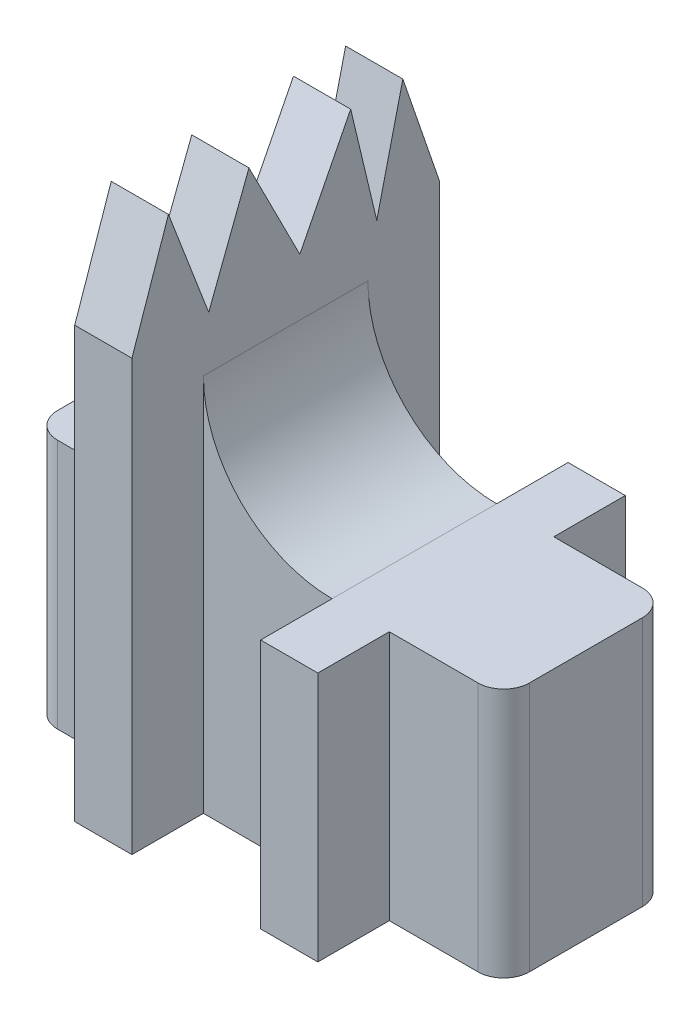
ISO-10303-21;
HEADER;
FILE_DESCRIPTION(('STEP AP214'),'2;1');
FILE_NAME('part.step','',(''),(''),'','','');
FILE_SCHEMA(('AUTOMOTIVE_DESIGN { 1 0 10303 214 1 1 1 1 }'));
ENDSEC;
DATA;
#1=APPLICATION_CONTEXT('core data for automotive mechanical design processes');
#2=APPLICATION_PROTOCOL_DEFINITION('international standard','automotive_design',2000,#1);
#3=PRODUCT_CONTEXT('',#1,'mechanical');
#4=PRODUCT('Part','Part','',(#3));
#5=PRODUCT_RELATED_PRODUCT_CATEGORY('part','',(#4));
#6=PRODUCT_DEFINITION_FORMATION('','',#4);
#7=PRODUCT_DEFINITION_CONTEXT('part definition',#1,'design');
#8=PRODUCT_DEFINITION('design','',#6,#7);
#9=PRODUCT_DEFINITION_SHAPE('','',#8);
#10=(LENGTH_UNIT() NAMED_UNIT(*) SI_UNIT(.MILLI.,.METRE.));
#11=(NAMED_UNIT(*) PLANE_ANGLE_UNIT() SI_UNIT($,.RADIAN.));
#12=(NAMED_UNIT(*) SI_UNIT($,.STERADIAN.) SOLID_ANGLE_UNIT());
#13=UNCERTAINTY_MEASURE_WITH_UNIT(LENGTH_MEASURE(1.E-05),#10,'distance_accuracy_value','');
#14=(GEOMETRIC_REPRESENTATION_CONTEXT(3) GLOBAL_UNCERTAINTY_ASSIGNED_CONTEXT((#13)) GLOBAL_UNIT_ASSIGNED_CONTEXT((#10,
#11,#12)) REPRESENTATION_CONTEXT('',''));
#15=CARTESIAN_POINT('',(0.,0.,0.));
#16=DIRECTION('',(0.,0.,1.));
#17=DIRECTION('',(1.,0.,0.));
#18=AXIS2_PLACEMENT_3D('',#15,#16,#17);
#19=CARTESIAN_POINT('',(0.,8.75,0.));
#20=DIRECTION('',(0.,1.,0.));
#21=DIRECTION('',(0.,0.,1.));
#22=AXIS2_PLACEMENT_3D('',#19,#20,#21);
#23=PLANE('',#22);
#24=DIRECTION('',(0.,0.,1.));
#25=VECTOR('',#24,1.);
#26=CARTESIAN_POINT('',(-4.25,8.75,-5.375));
#27=LINE('',#26,#25);
#28=CARTESIAN_POINT('',(-4.25,8.75,-2.875));
#29=VERTEX_POINT('',#28);
#30=CARTESIAN_POINT('',(-4.25,8.75,2.875));
#31=VERTEX_POINT('',#30);
#32=EDGE_CURVE('E355',#29,#31,#27,.T.);
#33=ORIENTED_EDGE('',*,*,#32,.F.);
#34=DIRECTION('',(1.,0.,0.));
#35=VECTOR('',#34,1.);
#36=CARTESIAN_POINT('',(0.,8.75,-2.875));
#37=LINE('',#36,#35);
#38=CARTESIAN_POINT('',(-7.35,8.75,-2.875));
#39=VERTEX_POINT('',#38);
#40=EDGE_CURVE('E398',#39,#29,#37,.T.);
#41=ORIENTED_EDGE('',*,*,#40,.F.);
#42=CARTESIAN_POINT('',(-7.35,8.75,-1.975));
#43=DIRECTION('',(0.,1.,0.));
#44=DIRECTION('',(0.,0.,1.));
#45=AXIS2_PLACEMENT_3D('',#42,#43,#44);
#46=CIRCLE('',#45,0.9);
#47=CARTESIAN_POINT('',(-8.25,8.75,-1.975));
#48=VERTEX_POINT('',#47);
#49=EDGE_CURVE('E552',#39,#48,#46,.T.);
#50=ORIENTED_EDGE('',*,*,#49,.T.);
#51=DIRECTION('',(0.,0.,-1.));
#52=VECTOR('',#51,1.);
#53=CARTESIAN_POINT('',(-8.25,8.75,0.));
#54=LINE('',#53,#52);
#55=CARTESIAN_POINT('',(-8.25,8.75,1.975));
#56=VERTEX_POINT('',#55);
#57=EDGE_CURVE('E402',#56,#48,#54,.T.);
#58=ORIENTED_EDGE('',*,*,#57,.F.);
#59=CARTESIAN_POINT('',(-7.35,8.75,1.975));
#60=DIRECTION('',(0.,1.,0.));
#61=DIRECTION('',(0.,0.,1.));
#62=AXIS2_PLACEMENT_3D('',#59,#60,#61);
#63=CIRCLE('',#62,0.9);
#64=CARTESIAN_POINT('',(-7.35,8.75,2.875));
#65=VERTEX_POINT('',#64);
#66=EDGE_CURVE('E555',#56,#65,#63,.T.);
#67=ORIENTED_EDGE('',*,*,#66,.T.);
#68=DIRECTION('',(1.,0.,0.));
#69=VECTOR('',#68,1.);
#70=CARTESIAN_POINT('',(0.,8.75,2.875));
#71=LINE('',#70,#69);
#72=EDGE_CURVE('E361',#65,#31,#71,.T.);
#73=ORIENTED_EDGE('',*,*,#72,.T.);
#74=EDGE_LOOP('',(#33,#41,#50,#58,#67,#73));
#75=FACE_BOUND('',#74,.T.);
#76=ADVANCED_FACE('F60',(#75),#23,.T.);
#77=CARTESIAN_POINT('',(0.,8.75,2.875));
#78=DIRECTION('',(0.,0.,-1.));
#79=DIRECTION('',(-1.,0.,0.));
#80=AXIS2_PLACEMENT_3D('',#77,#78,#79);
#81=PLANE('',#80);
#82=ORIENTED_EDGE('',*,*,#72,.F.);
#83=DIRECTION('',(0.,-1.,0.));
#84=VECTOR('',#83,1.);
#85=CARTESIAN_POINT('',(-7.35,0.,2.875));
#86=LINE('',#85,#84);
#87=CARTESIAN_POINT('',(-7.35,0.,2.875));
#88=VERTEX_POINT('',#87);
#89=EDGE_CURVE('E567',#65,#88,#86,.T.);
#90=ORIENTED_EDGE('',*,*,#89,.T.);
#91=DIRECTION('',(1.,0.,0.));
#92=VECTOR('',#91,1.);
#93=CARTESIAN_POINT('',(0.,0.,2.875));
#94=LINE('',#93,#92);
#95=CARTESIAN_POINT('',(-4.25,0.,2.875));
#96=VERTEX_POINT('',#95);
#97=EDGE_CURVE('E354',#88,#96,#94,.T.);
#98=ORIENTED_EDGE('',*,*,#97,.T.);
#99=DIRECTION('',(0.,-1.,0.));
#100=VECTOR('',#99,1.);
#101=CARTESIAN_POINT('',(-4.25,8.75,2.875));
#102=LINE('',#101,#100);
#103=EDGE_CURVE('E525',#31,#96,#102,.T.);
#104=ORIENTED_EDGE('',*,*,#103,.F.);
#105=EDGE_LOOP('',(#82,#90,#98,#104));
#106=FACE_BOUND('',#105,.T.);
#107=ADVANCED_FACE('F706',(#106),#81,.F.);
#108=CARTESIAN_POINT('',(0.,8.75,5.375));
#109=DIRECTION('',(0.,0.,-1.));
#110=DIRECTION('',(-1.,0.,0.));
#111=AXIS2_PLACEMENT_3D('',#108,#109,#110);
#112=PLANE('',#111);
#113=DIRECTION('',(0.,-1.,0.));
#114=VECTOR('',#113,1.);
#115=CARTESIAN_POINT('',(-2.25,8.75,5.375));
#116=LINE('',#115,#114);
#117=CARTESIAN_POINT('',(-2.25,15.0316881367215,5.375));
#118=VERTEX_POINT('',#117);
#119=CARTESIAN_POINT('',(-2.25,0.,5.375));
#120=VERTEX_POINT('',#119);
#121=EDGE_CURVE('E519',#118,#120,#116,.T.);
#122=ORIENTED_EDGE('',*,*,#121,.F.);
#123=DIRECTION('',(-1.,0.,0.));
#124=VECTOR('',#123,1.);
#125=CARTESIAN_POINT('',(8.25,15.0316881367215,5.375));
#126=LINE('',#125,#124);
#127=CARTESIAN_POINT('',(-4.25,15.0316881367215,5.375));
#128=VERTEX_POINT('',#127);
#129=EDGE_CURVE('E329',#118,#128,#126,.T.);
#130=ORIENTED_EDGE('',*,*,#129,.T.);
#131=DIRECTION('',(0.,-1.,0.));
#132=VECTOR('',#131,1.);
#133=CARTESIAN_POINT('',(-4.25,8.75,5.375));
#134=LINE('',#133,#132);
#135=CARTESIAN_POINT('',(-4.25,0.,5.375));
#136=VERTEX_POINT('',#135);
#137=EDGE_CURVE('E522',#128,#136,#134,.T.);
#138=ORIENTED_EDGE('',*,*,#137,.T.);
#139=DIRECTION('',(1.,0.,0.));
#140=VECTOR('',#139,1.);
#141=CARTESIAN_POINT('',(0.,0.,5.375));
#142=LINE('',#141,#140);
#143=EDGE_CURVE('E413',#136,#120,#142,.T.);
#144=ORIENTED_EDGE('',*,*,#143,.T.);
#145=EDGE_LOOP('',(#122,#130,#138,#144));
#146=FACE_BOUND('',#145,.T.);
#147=ADVANCED_FACE('F690',(#146),#112,.F.);
#148=CARTESIAN_POINT('',(0.,8.75,2.875));
#149=DIRECTION('',(0.,0.,-1.));
#150=DIRECTION('',(-1.,0.,0.));
#151=AXIS2_PLACEMENT_3D('',#148,#149,#150);
#152=PLANE('',#151);
#153=DIRECTION('',(1.,0.,0.));
#154=VECTOR('',#153,1.);
#155=CARTESIAN_POINT('',(0.,0.,2.875));
#156=LINE('',#155,#154);
#157=CARTESIAN_POINT('',(-2.25,0.,2.875));
#158=VERTEX_POINT('',#157);
#159=CARTESIAN_POINT('',(2.25,0.,2.875));
#160=VERTEX_POINT('',#159);
#161=EDGE_CURVE('E420',#158,#160,#156,.T.);
#162=ORIENTED_EDGE('',*,*,#161,.T.);
#163=DIRECTION('',(0.,-1.,0.));
#164=VECTOR('',#163,1.);
#165=CARTESIAN_POINT('',(2.25,8.75,2.875));
#166=LINE('',#165,#164);
#167=CARTESIAN_POINT('',(2.25,8.75,2.875));
#168=VERTEX_POINT('',#167);
#169=EDGE_CURVE('E514',#168,#160,#166,.T.);
#170=ORIENTED_EDGE('',*,*,#169,.F.);
#171=CARTESIAN_POINT('',(2.25,13.25,2.875));
#172=DIRECTION('',(0.,0.,-1.));
#173=DIRECTION('',(-1.,0.,0.));
#174=AXIS2_PLACEMENT_3D('',#171,#172,#173);
#175=CIRCLE('',#174,4.5);
#176=CARTESIAN_POINT('',(-2.25,13.25,2.875));
#177=VERTEX_POINT('',#176);
#178=EDGE_CURVE('E12',#168,#177,#175,.T.);
#179=ORIENTED_EDGE('',*,*,#178,.T.);
#180=DIRECTION('',(0.,-1.,0.));
#181=VECTOR('',#180,1.);
#182=CARTESIAN_POINT('',(-2.25,8.75,2.875));
#183=LINE('',#182,#181);
#184=EDGE_CURVE('E84',#177,#158,#183,.T.);
#185=ORIENTED_EDGE('',*,*,#184,.T.);
#186=EDGE_LOOP('',(#162,#170,#179,#185));
#187=FACE_BOUND('',#186,.T.);
#188=ADVANCED_FACE('F615',(#187),#152,.F.);
#189=CARTESIAN_POINT('',(2.25,8.75,0.));
#190=DIRECTION('',(-1.,0.,0.));
#191=DIRECTION('',(0.,0.,1.));
#192=AXIS2_PLACEMENT_3D('',#189,#190,#191);
#193=PLANE('',#192);
#194=DIRECTION('',(0.,0.,-1.));
#195=VECTOR('',#194,1.);
#196=CARTESIAN_POINT('',(2.25,0.,0.));
#197=LINE('',#196,#195);
#198=CARTESIAN_POINT('',(2.25,0.,5.375));
#199=VERTEX_POINT('',#198);
#200=EDGE_CURVE('E424',#199,#160,#197,.T.);
#201=ORIENTED_EDGE('',*,*,#200,.F.);
#202=DIRECTION('',(0.,-1.,0.));
#203=VECTOR('',#202,1.);
#204=CARTESIAN_POINT('',(2.25,8.75,5.375));
#205=LINE('',#204,#203);
#206=CARTESIAN_POINT('',(2.25,8.75,5.375));
#207=VERTEX_POINT('',#206);
#208=EDGE_CURVE('E511',#207,#199,#205,.T.);
#209=ORIENTED_EDGE('',*,*,#208,.F.);
#210=DIRECTION('',(0.,0.,-1.));
#211=VECTOR('',#210,1.);
#212=CARTESIAN_POINT('',(2.25,8.75,0.));
#213=LINE('',#212,#211);
#214=EDGE_CURVE('E364',#207,#168,#213,.T.);
#215=ORIENTED_EDGE('',*,*,#214,.T.);
#216=ORIENTED_EDGE('',*,*,#169,.T.);
#217=EDGE_LOOP('',(#201,#209,#215,#216));
#218=FACE_BOUND('',#217,.T.);
#219=ADVANCED_FACE('F619',(#218),#193,.T.);
#220=CARTESIAN_POINT('',(0.,8.75,5.375));
#221=DIRECTION('',(0.,0.,1.));
#222=DIRECTION('',(1.,0.,0.));
#223=AXIS2_PLACEMENT_3D('',#220,#221,#222);
#224=PLANE('',#223);
#225=DIRECTION('',(-1.,0.,0.));
#226=VECTOR('',#225,1.);
#227=CARTESIAN_POINT('',(0.,0.,5.375));
#228=LINE('',#227,#226);
#229=CARTESIAN_POINT('',(4.25,0.,5.375));
#230=VERTEX_POINT('',#229);
#231=EDGE_CURVE('E428',#230,#199,#228,.T.);
#232=ORIENTED_EDGE('',*,*,#231,.F.);
#233=DIRECTION('',(0.,-1.,0.));
#234=VECTOR('',#233,1.);
#235=CARTESIAN_POINT('',(4.25,8.75,5.375));
#236=LINE('',#235,#234);
#237=CARTESIAN_POINT('',(4.25,8.75,5.375));
#238=VERTEX_POINT('',#237);
#239=EDGE_CURVE('E508',#238,#230,#236,.T.);
#240=ORIENTED_EDGE('',*,*,#239,.F.);
#241=DIRECTION('',(-1.,0.,0.));
#242=VECTOR('',#241,1.);
#243=CARTESIAN_POINT('',(0.,8.75,5.375));
#244=LINE('',#243,#242);
#245=EDGE_CURVE('E369',#238,#207,#244,.T.);
#246=ORIENTED_EDGE('',*,*,#245,.T.);
#247=ORIENTED_EDGE('',*,*,#208,.T.);
#248=EDGE_LOOP('',(#232,#240,#246,#247));
#249=FACE_BOUND('',#248,.T.);
#250=ADVANCED_FACE('F623',(#249),#224,.T.);
#251=CARTESIAN_POINT('',(4.25,8.75,0.));
#252=DIRECTION('',(-1.,0.,0.));
#253=DIRECTION('',(0.,0.,1.));
#254=AXIS2_PLACEMENT_3D('',#251,#252,#253);
#255=PLANE('',#254);
#256=DIRECTION('',(0.,0.,-1.));
#257=VECTOR('',#256,1.);
#258=CARTESIAN_POINT('',(4.25,0.,0.));
#259=LINE('',#258,#257);
#260=CARTESIAN_POINT('',(4.25,0.,2.875));
#261=VERTEX_POINT('',#260);
#262=EDGE_CURVE('E432',#230,#261,#259,.T.);
#263=ORIENTED_EDGE('',*,*,#262,.T.);
#264=DIRECTION('',(0.,-1.,0.));
#265=VECTOR('',#264,1.);
#266=CARTESIAN_POINT('',(4.25,8.75,2.875));
#267=LINE('',#266,#265);
#268=CARTESIAN_POINT('',(4.25,8.75,2.875));
#269=VERTEX_POINT('',#268);
#270=EDGE_CURVE('E504',#269,#261,#267,.T.);
#271=ORIENTED_EDGE('',*,*,#270,.F.);
#272=DIRECTION('',(0.,0.,-1.));
#273=VECTOR('',#272,1.);
#274=CARTESIAN_POINT('',(4.25,8.75,0.));
#275=LINE('',#274,#273);
#276=EDGE_CURVE('E373',#238,#269,#275,.T.);
#277=ORIENTED_EDGE('',*,*,#276,.F.);
#278=ORIENTED_EDGE('',*,*,#239,.T.);
#279=EDGE_LOOP('',(#263,#271,#277,#278));
#280=FACE_BOUND('',#279,.T.);
#281=ADVANCED_FACE('F628',(#280),#255,.F.);
#282=CARTESIAN_POINT('',(0.,8.75,2.875));
#283=DIRECTION('',(0.,0.,-1.));
#284=DIRECTION('',(-1.,0.,0.));
#285=AXIS2_PLACEMENT_3D('',#282,#283,#284);
#286=PLANE('',#285);
#287=DIRECTION('',(1.,0.,0.));
#288=VECTOR('',#287,1.);
#289=CARTESIAN_POINT('',(0.,0.,2.875));
#290=LINE('',#289,#288);
#291=CARTESIAN_POINT('',(7.35,0.,2.875));
#292=VERTEX_POINT('',#291);
#293=EDGE_CURVE('E435',#261,#292,#290,.T.);
#294=ORIENTED_EDGE('',*,*,#293,.T.);
#295=DIRECTION('',(0.,-1.,0.));
#296=VECTOR('',#295,1.);
#297=CARTESIAN_POINT('',(7.35,8.75,2.875));
#298=LINE('',#297,#296);
#299=CARTESIAN_POINT('',(7.35,8.75,2.875));
#300=VERTEX_POINT('',#299);
#301=EDGE_CURVE('E564',#292,#300,#298,.F.);
#302=ORIENTED_EDGE('',*,*,#301,.T.);
#303=DIRECTION('',(1.,0.,0.));
#304=VECTOR('',#303,1.);
#305=CARTESIAN_POINT('',(0.,8.75,2.875));
#306=LINE('',#305,#304);
#307=EDGE_CURVE('E376',#269,#300,#306,.T.);
#308=ORIENTED_EDGE('',*,*,#307,.F.);
#309=ORIENTED_EDGE('',*,*,#270,.T.);
#310=EDGE_LOOP('',(#294,#302,#308,#309));
#311=FACE_BOUND('',#310,.T.);
#312=ADVANCED_FACE('F696',(#311),#286,.F.);
#313=CARTESIAN_POINT('',(8.25,8.75,0.));
#314=DIRECTION('',(-1.,0.,0.));
#315=DIRECTION('',(0.,0.,1.));
#316=AXIS2_PLACEMENT_3D('',#313,#314,#315);
#317=PLANE('',#316);
#318=DIRECTION('',(0.,0.,-1.));
#319=VECTOR('',#318,1.);
#320=CARTESIAN_POINT('',(8.25,0.,0.));
#321=LINE('',#320,#319);
#322=CARTESIAN_POINT('',(8.25,0.,1.975));
#323=VERTEX_POINT('',#322);
#324=CARTESIAN_POINT('',(8.25,0.,-1.975));
#325=VERTEX_POINT('',#324);
#326=EDGE_CURVE('E439',#323,#325,#321,.T.);
#327=ORIENTED_EDGE('',*,*,#326,.T.);
#328=DIRECTION('',(0.,-1.,0.));
#329=VECTOR('',#328,1.);
#330=CARTESIAN_POINT('',(8.25,8.75,-1.975));
#331=LINE('',#330,#329);
#332=CARTESIAN_POINT('',(8.25,8.75,-1.975));
#333=VERTEX_POINT('',#332);
#334=EDGE_CURVE('E549',#325,#333,#331,.F.);
#335=ORIENTED_EDGE('',*,*,#334,.T.);
#336=DIRECTION('',(0.,0.,-1.));
#337=VECTOR('',#336,1.);
#338=CARTESIAN_POINT('',(8.25,8.75,0.));
#339=LINE('',#338,#337);
#340=CARTESIAN_POINT('',(8.25,8.75,1.975));
#341=VERTEX_POINT('',#340);
#342=EDGE_CURVE('E380',#341,#333,#339,.T.);
#343=ORIENTED_EDGE('',*,*,#342,.F.);
#344=DIRECTION('',(0.,-1.,0.));
#345=VECTOR('',#344,1.);
#346=CARTESIAN_POINT('',(8.25,8.75,1.975));
#347=LINE('',#346,#345);
#348=EDGE_CURVE('E545',#341,#323,#347,.T.);
#349=ORIENTED_EDGE('',*,*,#348,.T.);
#350=EDGE_LOOP('',(#327,#335,#343,#349));
#351=FACE_BOUND('',#350,.T.);
#352=ADVANCED_FACE('F639',(#351),#317,.F.);
#353=CARTESIAN_POINT('',(0.,8.75,-2.875));
#354=DIRECTION('',(0.,0.,-1.));
#355=DIRECTION('',(-1.,0.,0.));
#356=AXIS2_PLACEMENT_3D('',#353,#354,#355);
#357=PLANE('',#356);
#358=DIRECTION('',(1.,0.,0.));
#359=VECTOR('',#358,1.);
#360=CARTESIAN_POINT('',(0.,8.75,-2.875));
#361=LINE('',#360,#359);
#362=CARTESIAN_POINT('',(4.25,8.75,-2.875));
#363=VERTEX_POINT('',#362);
#364=CARTESIAN_POINT('',(7.35,8.75,-2.875));
#365=VERTEX_POINT('',#364);
#366=EDGE_CURVE('E384',#363,#365,#361,.T.);
#367=ORIENTED_EDGE('',*,*,#366,.T.);
#368=DIRECTION('',(0.,-1.,0.));
#369=VECTOR('',#368,1.);
#370=CARTESIAN_POINT('',(7.35,0.,-2.875));
#371=LINE('',#370,#369);
#372=CARTESIAN_POINT('',(7.35,0.,-2.875));
#373=VERTEX_POINT('',#372);
#374=EDGE_CURVE('E529',#365,#373,#371,.T.);
#375=ORIENTED_EDGE('',*,*,#374,.T.);
#376=DIRECTION('',(1.,0.,0.));
#377=VECTOR('',#376,1.);
#378=CARTESIAN_POINT('',(0.,0.,-2.875));
#379=LINE('',#378,#377);
#380=CARTESIAN_POINT('',(4.25,0.,-2.875));
#381=VERTEX_POINT('',#380);
#382=EDGE_CURVE('E443',#381,#373,#379,.T.);
#383=ORIENTED_EDGE('',*,*,#382,.F.);
#384=DIRECTION('',(0.,-1.,0.));
#385=VECTOR('',#384,1.);
#386=CARTESIAN_POINT('',(4.25,8.75,-2.875));
#387=LINE('',#386,#385);
#388=EDGE_CURVE('E501',#363,#381,#387,.T.);
#389=ORIENTED_EDGE('',*,*,#388,.F.);
#390=EDGE_LOOP('',(#367,#375,#383,#389));
#391=FACE_BOUND('',#390,.T.);
#392=ADVANCED_FACE('F651',(#391),#357,.T.);
#393=CARTESIAN_POINT('',(4.25,8.75,0.));
#394=DIRECTION('',(-1.,0.,0.));
#395=DIRECTION('',(0.,0.,1.));
#396=AXIS2_PLACEMENT_3D('',#393,#394,#395);
#397=PLANE('',#396);
#398=DIRECTION('',(0.,0.,-1.));
#399=VECTOR('',#398,1.);
#400=CARTESIAN_POINT('',(4.25,0.,0.));
#401=LINE('',#400,#399);
#402=CARTESIAN_POINT('',(4.25,0.,-5.375));
#403=VERTEX_POINT('',#402);
#404=EDGE_CURVE('E447',#381,#403,#401,.T.);
#405=ORIENTED_EDGE('',*,*,#404,.T.);
#406=DIRECTION('',(0.,-1.,0.));
#407=VECTOR('',#406,1.);
#408=CARTESIAN_POINT('',(4.25,8.75,-5.375));
#409=LINE('',#408,#407);
#410=CARTESIAN_POINT('',(4.25,8.75,-5.375));
#411=VERTEX_POINT('',#410);
#412=EDGE_CURVE('E497',#411,#403,#409,.T.);
#413=ORIENTED_EDGE('',*,*,#412,.F.);
#414=DIRECTION('',(0.,0.,-1.));
#415=VECTOR('',#414,1.);
#416=CARTESIAN_POINT('',(4.25,8.75,0.));
#417=LINE('',#416,#415);
#418=EDGE_CURVE('E388',#363,#411,#417,.T.);
#419=ORIENTED_EDGE('',*,*,#418,.F.);
#420=ORIENTED_EDGE('',*,*,#388,.T.);
#421=EDGE_LOOP('',(#405,#413,#419,#420));
#422=FACE_BOUND('',#421,.T.);
#423=ADVANCED_FACE('F656',(#422),#397,.F.);
#424=CARTESIAN_POINT('',(0.,8.75,-5.375));
#425=DIRECTION('',(0.,0.,1.));
#426=DIRECTION('',(1.,0.,0.));
#427=AXIS2_PLACEMENT_3D('',#424,#425,#426);
#428=PLANE('',#427);
#429=DIRECTION('',(-1.,0.,0.));
#430=VECTOR('',#429,1.);
#431=CARTESIAN_POINT('',(0.,0.,-5.375));
#432=LINE('',#431,#430);
#433=CARTESIAN_POINT('',(2.25,0.,-5.375));
#434=VERTEX_POINT('',#433);
#435=EDGE_CURVE('E450',#403,#434,#432,.T.);
#436=ORIENTED_EDGE('',*,*,#435,.T.);
#437=DIRECTION('',(0.,-1.,0.));
#438=VECTOR('',#437,1.);
#439=CARTESIAN_POINT('',(2.25,8.75,-5.375));
#440=LINE('',#439,#438);
#441=CARTESIAN_POINT('',(2.25,8.75,-5.375));
#442=VERTEX_POINT('',#441);
#443=EDGE_CURVE('E494',#442,#434,#440,.T.);
#444=ORIENTED_EDGE('',*,*,#443,.F.);
#445=DIRECTION('',(-1.,0.,0.));
#446=VECTOR('',#445,1.);
#447=CARTESIAN_POINT('',(0.,8.75,-5.375));
#448=LINE('',#447,#446);
#449=EDGE_CURVE('E391',#411,#442,#448,.T.);
#450=ORIENTED_EDGE('',*,*,#449,.F.);
#451=ORIENTED_EDGE('',*,*,#412,.T.);
#452=EDGE_LOOP('',(#436,#444,#450,#451));
#453=FACE_BOUND('',#452,.T.);
#454=ADVANCED_FACE('F659',(#453),#428,.F.);
#455=CARTESIAN_POINT('',(2.25,8.75,0.));
#456=DIRECTION('',(-1.,0.,0.));
#457=DIRECTION('',(0.,0.,1.));
#458=AXIS2_PLACEMENT_3D('',#455,#456,#457);
#459=PLANE('',#458);
#460=DIRECTION('',(0.,0.,-1.));
#461=VECTOR('',#460,1.);
#462=CARTESIAN_POINT('',(2.25,0.,0.));
#463=LINE('',#462,#461);
#464=CARTESIAN_POINT('',(2.25,0.,-2.875));
#465=VERTEX_POINT('',#464);
#466=EDGE_CURVE('E454',#465,#434,#463,.T.);
#467=ORIENTED_EDGE('',*,*,#466,.F.);
#468=DIRECTION('',(0.,-1.,0.));
#469=VECTOR('',#468,1.);
#470=CARTESIAN_POINT('',(2.25,8.75,-2.875));
#471=LINE('',#470,#469);
#472=CARTESIAN_POINT('',(2.25,8.75,-2.875));
#473=VERTEX_POINT('',#472);
#474=EDGE_CURVE('E491',#473,#465,#471,.T.);
#475=ORIENTED_EDGE('',*,*,#474,.F.);
#476=DIRECTION('',(0.,0.,-1.));
#477=VECTOR('',#476,1.);
#478=CARTESIAN_POINT('',(2.25,8.75,0.));
#479=LINE('',#478,#477);
#480=EDGE_CURVE('E394',#473,#442,#479,.T.);
#481=ORIENTED_EDGE('',*,*,#480,.T.);
#482=ORIENTED_EDGE('',*,*,#443,.T.);
#483=EDGE_LOOP('',(#467,#475,#481,#482));
#484=FACE_BOUND('',#483,.T.);
#485=ADVANCED_FACE('F606',(#484),#459,.T.);
#486=CARTESIAN_POINT('',(0.,8.75,-2.875));
#487=DIRECTION('',(0.,0.,-1.));
#488=DIRECTION('',(-1.,0.,0.));
#489=AXIS2_PLACEMENT_3D('',#486,#487,#488);
#490=PLANE('',#489);
#491=DIRECTION('',(1.,0.,0.));
#492=VECTOR('',#491,1.);
#493=CARTESIAN_POINT('',(0.,0.,-2.875));
#494=LINE('',#493,#492);
#495=CARTESIAN_POINT('',(-2.25,0.,-2.875));
#496=VERTEX_POINT('',#495);
#497=EDGE_CURVE('E458',#496,#465,#494,.T.);
#498=ORIENTED_EDGE('',*,*,#497,.F.);
#499=DIRECTION('',(0.,-1.,0.));
#500=VECTOR('',#499,1.);
#501=CARTESIAN_POINT('',(-2.25,8.75,-2.875));
#502=LINE('',#501,#500);
#503=CARTESIAN_POINT('',(-2.25,13.25,-2.875));
#504=VERTEX_POINT('',#503);
#505=EDGE_CURVE('E76',#504,#496,#502,.T.);
#506=ORIENTED_EDGE('',*,*,#505,.F.);
#507=CARTESIAN_POINT('',(2.25,13.25,-2.875));
#508=DIRECTION('',(0.,0.,-1.));
#509=DIRECTION('',(-1.,0.,0.));
#510=AXIS2_PLACEMENT_3D('',#507,#508,#509);
#511=CIRCLE('',#510,4.5);
#512=EDGE_CURVE('E69',#504,#473,#511,.F.);
#513=ORIENTED_EDGE('',*,*,#512,.T.);
#514=ORIENTED_EDGE('',*,*,#474,.T.);
#515=EDGE_LOOP('',(#498,#506,#513,#514));
#516=FACE_BOUND('',#515,.T.);
#517=ADVANCED_FACE('F599',(#516),#490,.T.);
#518=CARTESIAN_POINT('',(-2.25,8.75,0.));
#519=DIRECTION('',(-1.,0.,0.));
#520=DIRECTION('',(0.,0.,1.));
#521=AXIS2_PLACEMENT_3D('',#518,#519,#520);
#522=PLANE('',#521);
#523=DIRECTION('',(0.,0.,-1.));
#524=VECTOR('',#523,1.);
#525=CARTESIAN_POINT('',(-2.25,13.25,0.));
#526=LINE('',#525,#524);
#527=EDGE_CURVE('E592',#177,#504,#526,.T.);
#528=ORIENTED_EDGE('',*,*,#527,.T.);
#529=ORIENTED_EDGE('',*,*,#505,.T.);
#530=DIRECTION('',(0.,0.,-1.));
#531=VECTOR('',#530,1.);
#532=CARTESIAN_POINT('',(-2.25,0.,0.));
#533=LINE('',#532,#531);
#534=CARTESIAN_POINT('',(-2.25,0.,-5.375));
#535=VERTEX_POINT('',#534);
#536=EDGE_CURVE('E462',#496,#535,#533,.T.);
#537=ORIENTED_EDGE('',*,*,#536,.T.);
#538=DIRECTION('',(0.,-1.,0.));
#539=VECTOR('',#538,1.);
#540=CARTESIAN_POINT('',(-2.25,8.75,-5.375));
#541=LINE('',#540,#539);
#542=CARTESIAN_POINT('',(-2.25,15.0316881367215,-5.375));
#543=VERTEX_POINT('',#542);
#544=EDGE_CURVE('E486',#543,#535,#541,.T.);
#545=ORIENTED_EDGE('',*,*,#544,.F.);
#546=DIRECTION('',(0.,0.945769119266733,0.324839611256737));
#547=VECTOR('',#546,1.);
#548=CARTESIAN_POINT('',(-2.25,11.0641736807886,-6.73770663449018));
#549=LINE('',#548,#547);
#550=CARTESIAN_POINT('',(-2.25,18.75,-4.09788600294417));
#551=VERTEX_POINT('',#550);
#552=EDGE_CURVE('E350',#543,#551,#549,.T.);
#553=ORIENTED_EDGE('',*,*,#552,.T.);
#554=DIRECTION('',(0.,-0.972713781360868,0.232008404051752));
#555=VECTOR('',#554,1.);
#556=CARTESIAN_POINT('',(-2.25,8.36347721240002,-1.62052768668092));
#557=LINE('',#556,#555);
#558=CARTESIAN_POINT('',(-2.25,14.9257546116405,-3.18573991613306));
#559=VERTEX_POINT('',#558);
#560=EDGE_CURVE('E307',#551,#559,#557,.T.);
#561=ORIENTED_EDGE('',*,*,#560,.T.);
#562=DIRECTION('',(0.,0.972713781360868,0.232008404051752));
#563=VECTOR('',#562,1.);
#564=CARTESIAN_POINT('',(-2.25,9.80137858536957,-4.40798876918505));
#565=LINE('',#564,#563);
#566=CARTESIAN_POINT('',(-2.25,18.75,-2.27359382932194));
#567=VERTEX_POINT('',#566);
#568=EDGE_CURVE('E311',#559,#567,#565,.T.);
#569=ORIENTED_EDGE('',*,*,#568,.T.);
#570=DIRECTION('',(0.,-0.891877422818349,0.452277196713366));
#571=VECTOR('',#570,1.);
#572=CARTESIAN_POINT('',(-2.25,9.87843385004557,2.22523859551879));
#573=LINE('',#572,#571);
#574=CARTESIAN_POINT('',(-2.25,15.2435645134757,-0.495456193221598));
#575=VERTEX_POINT('',#574);
#576=EDGE_CURVE('E346',#567,#575,#573,.T.);
#577=ORIENTED_EDGE('',*,*,#576,.T.);
#578=DIRECTION('',(0.,0.891877422818349,0.452277196713366));
#579=VECTOR('',#578,1.);
#580=CARTESIAN_POINT('',(-2.25,10.278143947074,-3.01345523302064));
#581=LINE('',#580,#579);
#582=CARTESIAN_POINT('',(-2.25,18.75,1.28268144287875));
#583=VERTEX_POINT('',#582);
#584=EDGE_CURVE('E342',#575,#583,#581,.T.);
#585=ORIENTED_EDGE('',*,*,#584,.T.);
#586=DIRECTION('',(0.,-0.933710127113187,0.358029884962521));
#587=VECTOR('',#586,1.);
#588=CARTESIAN_POINT('',(-2.25,10.4606494268686,4.46122170492784));
#589=LINE('',#588,#587);
#590=CARTESIAN_POINT('',(-2.25,15.0790983266614,2.69028372291146));
#591=VERTEX_POINT('',#590);
#592=EDGE_CURVE('E274',#583,#591,#589,.T.);
#593=ORIENTED_EDGE('',*,*,#592,.T.);
#594=DIRECTION('',(0.,0.933710127113187,0.358029884962521));
#595=VECTOR('',#594,1.);
#596=CARTESIAN_POINT('',(-2.25,8.66194655576152,0.229635558554773));
#597=LINE('',#596,#595);
#598=CARTESIAN_POINT('',(-2.25,18.75,4.09788600294418));
#599=VERTEX_POINT('',#598);
#600=EDGE_CURVE('E270',#591,#599,#597,.T.);
#601=ORIENTED_EDGE('',*,*,#600,.T.);
#602=DIRECTION('',(0.,-0.945769119266733,0.324839611256737));
#603=VECTOR('',#602,1.);
#604=CARTESIAN_POINT('',(-2.25,11.0641736807886,6.73770663449018));
#605=LINE('',#604,#603);
#606=EDGE_CURVE('E323',#599,#118,#605,.T.);
#607=ORIENTED_EDGE('',*,*,#606,.T.);
#608=ORIENTED_EDGE('',*,*,#121,.T.);
#609=DIRECTION('',(0.,0.,-1.));
#610=VECTOR('',#609,1.);
#611=CARTESIAN_POINT('',(-2.25,0.,0.));
#612=LINE('',#611,#610);
#613=EDGE_CURVE('E417',#120,#158,#612,.T.);
#614=ORIENTED_EDGE('',*,*,#613,.T.);
#615=ORIENTED_EDGE('',*,*,#184,.F.);
#616=EDGE_LOOP('',(#528,#529,#537,#545,#553,#561,#569,#577,#585,#593,#601,#607,#608,#614,#615));
#617=FACE_BOUND('',#616,.T.);
#618=ADVANCED_FACE('F663',(#617),#522,.F.);
#619=CARTESIAN_POINT('',(0.,8.75,-5.375));
#620=DIRECTION('',(0.,0.,-1.));
#621=DIRECTION('',(-1.,0.,0.));
#622=AXIS2_PLACEMENT_3D('',#619,#620,#621);
#623=PLANE('',#622);
#624=DIRECTION('',(-1.,0.,0.));
#625=VECTOR('',#624,1.);
#626=CARTESIAN_POINT('',(8.25,15.0316881367215,-5.375));
#627=LINE('',#626,#625);
#628=CARTESIAN_POINT('',(-4.25,15.0316881367215,-5.375));
#629=VERTEX_POINT('',#628);
#630=EDGE_CURVE('E319',#543,#629,#627,.T.);
#631=ORIENTED_EDGE('',*,*,#630,.F.);
#632=ORIENTED_EDGE('',*,*,#544,.T.);
#633=DIRECTION('',(1.,0.,0.));
#634=VECTOR('',#633,1.);
#635=CARTESIAN_POINT('',(0.,0.,-5.375));
#636=LINE('',#635,#634);
#637=CARTESIAN_POINT('',(-4.25,0.,-5.375));
#638=VERTEX_POINT('',#637);
#639=EDGE_CURVE('E466',#638,#535,#636,.T.);
#640=ORIENTED_EDGE('',*,*,#639,.F.);
#641=DIRECTION('',(0.,-1.,0.));
#642=VECTOR('',#641,1.);
#643=CARTESIAN_POINT('',(-4.25,8.75,-5.375));
#644=LINE('',#643,#642);
#645=EDGE_CURVE('E483',#629,#638,#644,.T.);
#646=ORIENTED_EDGE('',*,*,#645,.F.);
#647=EDGE_LOOP('',(#631,#632,#640,#646));
#648=FACE_BOUND('',#647,.T.);
#649=ADVANCED_FACE('F666',(#648),#623,.T.);
#650=CARTESIAN_POINT('',(-4.25,8.75,0.));
#651=DIRECTION('',(-1.,0.,0.));
#652=DIRECTION('',(0.,0.,1.));
#653=AXIS2_PLACEMENT_3D('',#650,#651,#652);
#654=PLANE('',#653);
#655=DIRECTION('',(0.,-0.933710127113187,0.358029884962521));
#656=VECTOR('',#655,1.);
#657=CARTESIAN_POINT('',(-4.25,2.83227166397355,7.38631283716624));
#658=LINE('',#657,#656);
#659=CARTESIAN_POINT('',(-4.25,18.75,1.28268144287875));
#660=VERTEX_POINT('',#659);
#661=CARTESIAN_POINT('',(-4.25,15.0790983266614,2.69028372291146));
#662=VERTEX_POINT('',#661);
#663=EDGE_CURVE('E277',#660,#662,#658,.T.);
#664=ORIENTED_EDGE('',*,*,#663,.F.);
#665=DIRECTION('',(0.,0.891877422818349,0.452277196713366));
#666=VECTOR('',#665,1.);
#667=CARTESIAN_POINT('',(-4.25,3.31799724540936,-6.5429936633076));
#668=LINE('',#667,#666);
#669=CARTESIAN_POINT('',(-4.25,15.2435645134757,-0.495456193221598));
#670=VERTEX_POINT('',#669);
#671=EDGE_CURVE('E328',#670,#660,#668,.T.);
#672=ORIENTED_EDGE('',*,*,#671,.F.);
#673=DIRECTION('',(0.,-0.891877422818349,0.452277196713366));
#674=VECTOR('',#673,1.);
#675=CARTESIAN_POINT('',(-4.25,2.91828714838094,5.75477702580575));
#676=LINE('',#675,#674);
#677=CARTESIAN_POINT('',(-4.25,18.75,-2.27359382932194));
#678=VERTEX_POINT('',#677);
#679=EDGE_CURVE('E324',#678,#670,#676,.T.);
#680=ORIENTED_EDGE('',*,*,#679,.F.);
#681=DIRECTION('',(0.,0.972713781360868,0.232008404051752));
#682=VECTOR('',#681,1.);
#683=CARTESIAN_POINT('',(-4.25,1.52237270643767,-6.382669274296));
#684=LINE('',#683,#682);
#685=CARTESIAN_POINT('',(-4.25,14.9257546116405,-3.18573991613306));
#686=VERTEX_POINT('',#685);
#687=EDGE_CURVE('E301',#686,#678,#684,.T.);
#688=ORIENTED_EDGE('',*,*,#687,.F.);
#689=DIRECTION('',(0.,-0.972713781360868,0.232008404051752));
#690=VECTOR('',#689,1.);
#691=CARTESIAN_POINT('',(-4.25,0.0844713334681322,0.354152818430032));
#692=LINE('',#691,#690);
#693=CARTESIAN_POINT('',(-4.25,18.75,-4.09788600294417));
#694=VERTEX_POINT('',#693);
#695=EDGE_CURVE('E297',#694,#686,#692,.T.);
#696=ORIENTED_EDGE('',*,*,#695,.F.);
#697=DIRECTION('',(0.,0.945769119266733,0.324839611256737));
#698=VECTOR('',#697,1.);
#699=CARTESIAN_POINT('',(-4.25,3.23748044490114,-9.42591027360096));
#700=LINE('',#699,#698);
#701=EDGE_CURVE('E315',#629,#694,#700,.T.);
#702=ORIENTED_EDGE('',*,*,#701,.F.);
#703=ORIENTED_EDGE('',*,*,#645,.T.);
#704=DIRECTION('',(0.,0.,-1.));
#705=VECTOR('',#704,1.);
#706=CARTESIAN_POINT('',(-4.25,0.,0.));
#707=LINE('',#706,#705);
#708=CARTESIAN_POINT('',(-4.25,0.,-2.875));
#709=VERTEX_POINT('',#708);
#710=EDGE_CURVE('E470',#709,#638,#707,.T.);
#711=ORIENTED_EDGE('',*,*,#710,.F.);
#712=DIRECTION('',(0.,-1.,0.));
#713=VECTOR('',#712,1.);
#714=CARTESIAN_POINT('',(-4.25,8.75,-2.875));
#715=LINE('',#714,#713);
#716=EDGE_CURVE('E406',#29,#709,#715,.T.);
#717=ORIENTED_EDGE('',*,*,#716,.F.);
#718=ORIENTED_EDGE('',*,*,#32,.T.);
#719=ORIENTED_EDGE('',*,*,#103,.T.);
#720=DIRECTION('',(0.,0.,-1.));
#721=VECTOR('',#720,1.);
#722=CARTESIAN_POINT('',(-4.25,0.,0.));
#723=LINE('',#722,#721);
#724=EDGE_CURVE('E409',#136,#96,#723,.T.);
#725=ORIENTED_EDGE('',*,*,#724,.F.);
#726=ORIENTED_EDGE('',*,*,#137,.F.);
#727=DIRECTION('',(0.,-0.945769119266733,0.324839611256737));
#728=VECTOR('',#727,1.);
#729=CARTESIAN_POINT('',(-4.25,3.23748044490113,9.42591027360096));
#730=LINE('',#729,#728);
#731=CARTESIAN_POINT('',(-4.25,18.75,4.09788600294418));
#732=VERTEX_POINT('',#731);
#733=EDGE_CURVE('E289',#732,#128,#730,.T.);
#734=ORIENTED_EDGE('',*,*,#733,.F.);
#735=DIRECTION('',(0.,0.933710127113187,0.358029884962521));
#736=VECTOR('',#735,1.);
#737=CARTESIAN_POINT('',(-4.25,1.03356879286643,-2.69545557368364));
#738=LINE('',#737,#736);
#739=EDGE_CURVE('E267',#662,#732,#738,.T.);
#740=ORIENTED_EDGE('',*,*,#739,.F.);
#741=EDGE_LOOP('',(#664,#672,#680,#688,#696,#702,#703,#711,#717,#718,#719,#725,#726,#734,#740));
#742=FACE_BOUND('',#741,.T.);
#743=ADVANCED_FACE('F287',(#742),#654,.T.);
#744=CARTESIAN_POINT('',(0.,8.75,-2.875));
#745=DIRECTION('',(0.,0.,-1.));
#746=DIRECTION('',(-1.,0.,0.));
#747=AXIS2_PLACEMENT_3D('',#744,#745,#746);
#748=PLANE('',#747);
#749=DIRECTION('',(1.,0.,0.));
#750=VECTOR('',#749,1.);
#751=CARTESIAN_POINT('',(0.,0.,-2.875));
#752=LINE('',#751,#750);
#753=CARTESIAN_POINT('',(-7.35,0.,-2.875));
#754=VERTEX_POINT('',#753);
#755=EDGE_CURVE('E474',#754,#709,#752,.T.);
#756=ORIENTED_EDGE('',*,*,#755,.F.);
#757=DIRECTION('',(0.,-1.,0.));
#758=VECTOR('',#757,1.);
#759=CARTESIAN_POINT('',(-7.35,8.75,-2.875));
#760=LINE('',#759,#758);
#761=EDGE_CURVE('E360',#754,#39,#760,.F.);
#762=ORIENTED_EDGE('',*,*,#761,.T.);
#763=ORIENTED_EDGE('',*,*,#40,.T.);
#764=ORIENTED_EDGE('',*,*,#716,.T.);
#765=EDGE_LOOP('',(#756,#762,#763,#764));
#766=FACE_BOUND('',#765,.T.);
#767=ADVANCED_FACE('F722',(#766),#748,.T.);
#768=CARTESIAN_POINT('',(-8.25,8.75,0.));
#769=DIRECTION('',(-1.,0.,0.));
#770=DIRECTION('',(0.,0.,1.));
#771=AXIS2_PLACEMENT_3D('',#768,#769,#770);
#772=PLANE('',#771);
#773=DIRECTION('',(0.,0.,-1.));
#774=VECTOR('',#773,1.);
#775=CARTESIAN_POINT('',(-8.25,0.,0.));
#776=LINE('',#775,#774);
#777=CARTESIAN_POINT('',(-8.25,0.,1.975));
#778=VERTEX_POINT('',#777);
#779=CARTESIAN_POINT('',(-8.25,0.,-1.975));
#780=VERTEX_POINT('',#779);
#781=EDGE_CURVE('E365',#778,#780,#776,.T.);
#782=ORIENTED_EDGE('',*,*,#781,.F.);
#783=DIRECTION('',(0.,-1.,0.));
#784=VECTOR('',#783,1.);
#785=CARTESIAN_POINT('',(-8.25,8.75,1.975));
#786=LINE('',#785,#784);
#787=EDGE_CURVE('E575',#778,#56,#786,.F.);
#788=ORIENTED_EDGE('',*,*,#787,.T.);
#789=ORIENTED_EDGE('',*,*,#57,.T.);
#790=DIRECTION('',(0.,-1.,0.));
#791=VECTOR('',#790,1.);
#792=CARTESIAN_POINT('',(-8.25,8.75,-1.975));
#793=LINE('',#792,#791);
#794=EDGE_CURVE('E571',#48,#780,#793,.T.);
#795=ORIENTED_EDGE('',*,*,#794,.T.);
#796=EDGE_LOOP('',(#782,#788,#789,#795));
#797=FACE_BOUND('',#796,.T.);
#798=ADVANCED_FACE('F717',(#797),#772,.T.);
#799=ORIENTED_EDGE('',*,*,#480,.F.);
#800=DIRECTION('',(0.,0.,-1.));
#801=VECTOR('',#800,1.);
#802=CARTESIAN_POINT('',(2.25,8.75,0.));
#803=LINE('',#802,#801);
#804=EDGE_CURVE('E595',#473,#168,#803,.F.);
#805=ORIENTED_EDGE('',*,*,#804,.T.);
#806=ORIENTED_EDGE('',*,*,#214,.F.);
#807=ORIENTED_EDGE('',*,*,#245,.F.);
#808=ORIENTED_EDGE('',*,*,#276,.T.);
#809=ORIENTED_EDGE('',*,*,#307,.T.);
#810=CARTESIAN_POINT('',(7.35,8.75,1.975));
#811=DIRECTION('',(0.,1.,0.));
#812=DIRECTION('',(0.,0.,1.));
#813=AXIS2_PLACEMENT_3D('',#810,#811,#812);
#814=CIRCLE('',#813,0.9);
#815=EDGE_CURVE('E558',#300,#341,#814,.T.);
#816=ORIENTED_EDGE('',*,*,#815,.T.);
#817=ORIENTED_EDGE('',*,*,#342,.T.);
#818=CARTESIAN_POINT('',(7.35,8.75,-1.975));
#819=DIRECTION('',(0.,1.,0.));
#820=DIRECTION('',(0.,0.,1.));
#821=AXIS2_PLACEMENT_3D('',#818,#819,#820);
#822=CIRCLE('',#821,0.9);
#823=EDGE_CURVE('E561',#333,#365,#822,.T.);
#824=ORIENTED_EDGE('',*,*,#823,.T.);
#825=ORIENTED_EDGE('',*,*,#366,.F.);
#826=ORIENTED_EDGE('',*,*,#418,.T.);
#827=ORIENTED_EDGE('',*,*,#449,.T.);
#828=EDGE_LOOP('',(#799,#805,#806,#807,#808,#809,#816,#817,#824,#825,#826,#827));
#829=FACE_BOUND('',#828,.T.);
#830=ADVANCED_FACE('F608',(#829),#23,.T.);
#831=CARTESIAN_POINT('',(0.,0.,0.));
#832=DIRECTION('',(0.,1.,0.));
#833=DIRECTION('',(0.,0.,1.));
#834=AXIS2_PLACEMENT_3D('',#831,#832,#833);
#835=PLANE('',#834);
#836=ORIENTED_EDGE('',*,*,#382,.T.);
#837=CARTESIAN_POINT('',(7.35,0.,-1.975));
#838=DIRECTION('',(0.,1.,0.));
#839=DIRECTION('',(0.,0.,1.));
#840=AXIS2_PLACEMENT_3D('',#837,#838,#839);
#841=CIRCLE('',#840,0.9);
#842=EDGE_CURVE('E542',#373,#325,#841,.F.);
#843=ORIENTED_EDGE('',*,*,#842,.T.);
#844=ORIENTED_EDGE('',*,*,#326,.F.);
#845=CARTESIAN_POINT('',(7.35,0.,1.975));
#846=DIRECTION('',(0.,1.,0.));
#847=DIRECTION('',(0.,0.,1.));
#848=AXIS2_PLACEMENT_3D('',#845,#846,#847);
#849=CIRCLE('',#848,0.9);
#850=EDGE_CURVE('E539',#323,#292,#849,.F.);
#851=ORIENTED_EDGE('',*,*,#850,.T.);
#852=ORIENTED_EDGE('',*,*,#293,.F.);
#853=ORIENTED_EDGE('',*,*,#262,.F.);
#854=ORIENTED_EDGE('',*,*,#231,.T.);
#855=ORIENTED_EDGE('',*,*,#200,.T.);
#856=ORIENTED_EDGE('',*,*,#161,.F.);
#857=ORIENTED_EDGE('',*,*,#613,.F.);
#858=ORIENTED_EDGE('',*,*,#143,.F.);
#859=ORIENTED_EDGE('',*,*,#724,.T.);
#860=ORIENTED_EDGE('',*,*,#97,.F.);
#861=CARTESIAN_POINT('',(-7.35,0.,1.975));
#862=DIRECTION('',(0.,1.,0.));
#863=DIRECTION('',(0.,0.,1.));
#864=AXIS2_PLACEMENT_3D('',#861,#862,#863);
#865=CIRCLE('',#864,0.9);
#866=EDGE_CURVE('E536',#88,#778,#865,.F.);
#867=ORIENTED_EDGE('',*,*,#866,.T.);
#868=ORIENTED_EDGE('',*,*,#781,.T.);
#869=CARTESIAN_POINT('',(-7.35,0.,-1.975));
#870=DIRECTION('',(0.,1.,0.));
#871=DIRECTION('',(0.,0.,1.));
#872=AXIS2_PLACEMENT_3D('',#869,#870,#871);
#873=CIRCLE('',#872,0.9);
#874=EDGE_CURVE('E533',#780,#754,#873,.F.);
#875=ORIENTED_EDGE('',*,*,#874,.T.);
#876=ORIENTED_EDGE('',*,*,#755,.T.);
#877=ORIENTED_EDGE('',*,*,#710,.T.);
#878=ORIENTED_EDGE('',*,*,#639,.T.);
#879=ORIENTED_EDGE('',*,*,#536,.F.);
#880=ORIENTED_EDGE('',*,*,#497,.T.);
#881=ORIENTED_EDGE('',*,*,#466,.T.);
#882=ORIENTED_EDGE('',*,*,#435,.F.);
#883=ORIENTED_EDGE('',*,*,#404,.F.);
#884=EDGE_LOOP('',(#836,#843,#844,#851,#852,#853,#854,#855,#856,#857,#858,#859,#860,#867,#868,
#875,#876,#877,#878,#879,#880,#881,#882,#883));
#885=FACE_BOUND('',#884,.T.);
#886=ADVANCED_FACE('F642',(#885),#835,.F.);
#887=CARTESIAN_POINT('',(7.35,8.75,-1.975));
#888=DIRECTION('',(0.,1.,0.));
#889=DIRECTION('',(0.,0.,1.));
#890=AXIS2_PLACEMENT_3D('',#887,#888,#889);
#891=CYLINDRICAL_SURFACE('',#890,0.9);
#892=ORIENTED_EDGE('',*,*,#823,.F.);
#893=ORIENTED_EDGE('',*,*,#334,.F.);
#894=ORIENTED_EDGE('',*,*,#842,.F.);
#895=ORIENTED_EDGE('',*,*,#374,.F.);
#896=EDGE_LOOP('',(#892,#893,#894,#895));
#897=FACE_BOUND('',#896,.T.);
#898=ADVANCED_FACE('F649',(#897),#891,.T.);
#899=CARTESIAN_POINT('',(7.35,8.75,1.975));
#900=DIRECTION('',(0.,-1.,0.));
#901=DIRECTION('',(0.,0.,-1.));
#902=AXIS2_PLACEMENT_3D('',#899,#900,#901);
#903=CYLINDRICAL_SURFACE('',#902,0.9);
#904=ORIENTED_EDGE('',*,*,#815,.F.);
#905=ORIENTED_EDGE('',*,*,#301,.F.);
#906=ORIENTED_EDGE('',*,*,#850,.F.);
#907=ORIENTED_EDGE('',*,*,#348,.F.);
#908=EDGE_LOOP('',(#904,#905,#906,#907));
#909=FACE_BOUND('',#908,.T.);
#910=ADVANCED_FACE('F636',(#909),#903,.T.);
#911=CARTESIAN_POINT('',(-7.35,8.75,1.975));
#912=DIRECTION('',(0.,1.,0.));
#913=DIRECTION('',(0.,0.,1.));
#914=AXIS2_PLACEMENT_3D('',#911,#912,#913);
#915=CYLINDRICAL_SURFACE('',#914,0.9);
#916=ORIENTED_EDGE('',*,*,#66,.F.);
#917=ORIENTED_EDGE('',*,*,#787,.F.);
#918=ORIENTED_EDGE('',*,*,#866,.F.);
#919=ORIENTED_EDGE('',*,*,#89,.F.);
#920=EDGE_LOOP('',(#916,#917,#918,#919));
#921=FACE_BOUND('',#920,.T.);
#922=ADVANCED_FACE('F976',(#921),#915,.T.);
#923=CARTESIAN_POINT('',(-7.35,8.75,-1.975));
#924=DIRECTION('',(0.,-1.,0.));
#925=DIRECTION('',(0.,0.,-1.));
#926=AXIS2_PLACEMENT_3D('',#923,#924,#925);
#927=CYLINDRICAL_SURFACE('',#926,0.9);
#928=ORIENTED_EDGE('',*,*,#49,.F.);
#929=ORIENTED_EDGE('',*,*,#761,.F.);
#930=ORIENTED_EDGE('',*,*,#874,.F.);
#931=ORIENTED_EDGE('',*,*,#794,.F.);
#932=EDGE_LOOP('',(#928,#929,#930,#931));
#933=FACE_BOUND('',#932,.T.);
#934=ADVANCED_FACE('F872',(#933),#927,.T.);
#935=CARTESIAN_POINT('',(8.25,3.23748044490113,9.42591027360096));
#936=DIRECTION('',(0.,-0.324839611256737,-0.945769119266733));
#937=DIRECTION('',(0.,0.945769119266733,-0.324839611256737));
#938=AXIS2_PLACEMENT_3D('',#935,#936,#937);
#939=PLANE('',#938);
#940=DIRECTION('',(-1.,0.,0.));
#941=VECTOR('',#940,1.);
#942=CARTESIAN_POINT('',(0.,18.75,4.09788600294417));
#943=LINE('',#942,#941);
#944=EDGE_CURVE('E359',#599,#732,#943,.T.);
#945=ORIENTED_EDGE('',*,*,#944,.T.);
#946=ORIENTED_EDGE('',*,*,#733,.T.);
#947=ORIENTED_EDGE('',*,*,#129,.F.);
#948=ORIENTED_EDGE('',*,*,#606,.F.);
#949=EDGE_LOOP('',(#945,#946,#947,#948));
#950=FACE_BOUND('',#949,.T.);
#951=ADVANCED_FACE('F688',(#950),#939,.F.);
#952=CARTESIAN_POINT('',(8.25,2.91828714838094,5.75477702580575));
#953=DIRECTION('',(0.,-0.452277196713366,-0.891877422818349));
#954=DIRECTION('',(0.,0.891877422818349,-0.452277196713366));
#955=AXIS2_PLACEMENT_3D('',#952,#953,#954);
#956=PLANE('',#955);
#957=DIRECTION('',(-1.,0.,0.));
#958=VECTOR('',#957,1.);
#959=CARTESIAN_POINT('',(0.,18.75,-2.27359382932195));
#960=LINE('',#959,#958);
#961=EDGE_CURVE('E584',#567,#678,#960,.T.);
#962=ORIENTED_EDGE('',*,*,#961,.T.);
#963=ORIENTED_EDGE('',*,*,#679,.T.);
#964=DIRECTION('',(-1.,0.,0.));
#965=VECTOR('',#964,1.);
#966=CARTESIAN_POINT('',(8.25,15.2435645134757,-0.495456193221598));
#967=LINE('',#966,#965);
#968=EDGE_CURVE('E320',#575,#670,#967,.T.);
#969=ORIENTED_EDGE('',*,*,#968,.F.);
#970=ORIENTED_EDGE('',*,*,#576,.F.);
#971=EDGE_LOOP('',(#962,#963,#969,#970));
#972=FACE_BOUND('',#971,.T.);
#973=ADVANCED_FACE('F682',(#972),#956,.F.);
#974=CARTESIAN_POINT('',(8.25,3.31799724540936,-6.5429936633076));
#975=DIRECTION('',(0.,-0.452277196713365,0.891877422818349));
#976=DIRECTION('',(0.,-0.891877422818349,-0.452277196713366));
#977=AXIS2_PLACEMENT_3D('',#974,#975,#976);
#978=PLANE('',#977);
#979=ORIENTED_EDGE('',*,*,#968,.T.);
#980=ORIENTED_EDGE('',*,*,#671,.T.);
#981=DIRECTION('',(1.,0.,0.));
#982=VECTOR('',#981,1.);
#983=CARTESIAN_POINT('',(0.,18.75,1.28268144287875));
#984=LINE('',#983,#982);
#985=EDGE_CURVE('E280',#660,#583,#984,.T.);
#986=ORIENTED_EDGE('',*,*,#985,.T.);
#987=ORIENTED_EDGE('',*,*,#584,.F.);
#988=EDGE_LOOP('',(#979,#980,#986,#987));
#989=FACE_BOUND('',#988,.T.);
#990=ADVANCED_FACE('F684',(#989),#978,.F.);
#991=CARTESIAN_POINT('',(8.25,3.23748044490114,-9.42591027360096));
#992=DIRECTION('',(0.,-0.324839611256737,0.945769119266733));
#993=DIRECTION('',(0.,-0.945769119266733,-0.324839611256737));
#994=AXIS2_PLACEMENT_3D('',#991,#992,#993);
#995=PLANE('',#994);
#996=ORIENTED_EDGE('',*,*,#630,.T.);
#997=ORIENTED_EDGE('',*,*,#701,.T.);
#998=DIRECTION('',(1.,0.,0.));
#999=VECTOR('',#998,1.);
#1000=CARTESIAN_POINT('',(0.,18.75,-4.09788600294417));
#1001=LINE('',#1000,#999);
#1002=EDGE_CURVE('E588',#694,#551,#1001,.T.);
#1003=ORIENTED_EDGE('',*,*,#1002,.T.);
#1004=ORIENTED_EDGE('',*,*,#552,.F.);
#1005=EDGE_LOOP('',(#996,#997,#1003,#1004));
#1006=FACE_BOUND('',#1005,.T.);
#1007=ADVANCED_FACE('F670',(#1006),#995,.F.);
#1008=CARTESIAN_POINT('',(8.25,1.52237270643767,-6.382669274296));
#1009=DIRECTION('',(0.,-0.232008404051752,0.972713781360868));
#1010=DIRECTION('',(0.,-0.972713781360868,-0.232008404051752));
#1011=AXIS2_PLACEMENT_3D('',#1008,#1009,#1010);
#1012=PLANE('',#1011);
#1013=DIRECTION('',(-1.,0.,0.));
#1014=VECTOR('',#1013,1.);
#1015=CARTESIAN_POINT('',(8.25,14.9257546116405,-3.18573991613306));
#1016=LINE('',#1015,#1014);
#1017=EDGE_CURVE('E304',#559,#686,#1016,.T.);
#1018=ORIENTED_EDGE('',*,*,#1017,.T.);
#1019=ORIENTED_EDGE('',*,*,#687,.T.);
#1020=ORIENTED_EDGE('',*,*,#961,.F.);
#1021=ORIENTED_EDGE('',*,*,#568,.F.);
#1022=EDGE_LOOP('',(#1018,#1019,#1020,#1021));
#1023=FACE_BOUND('',#1022,.T.);
#1024=ADVANCED_FACE('F893',(#1023),#1012,.F.);
#1025=CARTESIAN_POINT('',(8.25,0.0844713334681322,0.354152818430032));
#1026=DIRECTION('',(0.,-0.232008404051752,-0.972713781360868));
#1027=DIRECTION('',(0.,0.972713781360868,-0.232008404051752));
#1028=AXIS2_PLACEMENT_3D('',#1025,#1026,#1027);
#1029=PLANE('',#1028);
#1030=ORIENTED_EDGE('',*,*,#1002,.F.);
#1031=ORIENTED_EDGE('',*,*,#695,.T.);
#1032=ORIENTED_EDGE('',*,*,#1017,.F.);
#1033=ORIENTED_EDGE('',*,*,#560,.F.);
#1034=EDGE_LOOP('',(#1030,#1031,#1032,#1033));
#1035=FACE_BOUND('',#1034,.T.);
#1036=ADVANCED_FACE('F677',(#1035),#1029,.F.);
#1037=CARTESIAN_POINT('',(8.25,1.03356879286643,-2.69545557368364));
#1038=DIRECTION('',(0.,-0.358029884962521,0.933710127113187));
#1039=DIRECTION('',(0.,-0.933710127113187,-0.358029884962521));
#1040=AXIS2_PLACEMENT_3D('',#1037,#1038,#1039);
#1041=PLANE('',#1040);
#1042=DIRECTION('',(-1.,0.,0.));
#1043=VECTOR('',#1042,1.);
#1044=CARTESIAN_POINT('',(8.25,15.0790983266614,2.69028372291146));
#1045=LINE('',#1044,#1043);
#1046=EDGE_CURVE('E263',#591,#662,#1045,.T.);
#1047=ORIENTED_EDGE('',*,*,#1046,.T.);
#1048=ORIENTED_EDGE('',*,*,#739,.T.);
#1049=ORIENTED_EDGE('',*,*,#944,.F.);
#1050=ORIENTED_EDGE('',*,*,#600,.F.);
#1051=EDGE_LOOP('',(#1047,#1048,#1049,#1050));
#1052=FACE_BOUND('',#1051,.T.);
#1053=ADVANCED_FACE('F265',(#1052),#1041,.F.);
#1054=CARTESIAN_POINT('',(8.25,2.83227166397355,7.38631283716624));
#1055=DIRECTION('',(0.,-0.358029884962521,-0.933710127113187));
#1056=DIRECTION('',(0.,0.933710127113187,-0.358029884962521));
#1057=AXIS2_PLACEMENT_3D('',#1054,#1055,#1056);
#1058=PLANE('',#1057);
#1059=ORIENTED_EDGE('',*,*,#985,.F.);
#1060=ORIENTED_EDGE('',*,*,#663,.T.);
#1061=ORIENTED_EDGE('',*,*,#1046,.F.);
#1062=ORIENTED_EDGE('',*,*,#592,.F.);
#1063=EDGE_LOOP('',(#1059,#1060,#1061,#1062));
#1064=FACE_BOUND('',#1063,.T.);
#1065=ADVANCED_FACE('F278',(#1064),#1058,.F.);
#1066=CARTESIAN_POINT('',(2.25,13.25,0.));
#1067=DIRECTION('',(0.,0.,-1.));
#1068=DIRECTION('',(-1.,0.,0.));
#1069=AXIS2_PLACEMENT_3D('',#1066,#1067,#1068);
#1070=CYLINDRICAL_SURFACE('',#1069,4.5);
#1071=ORIENTED_EDGE('',*,*,#178,.F.);
#1072=ORIENTED_EDGE('',*,*,#804,.F.);
#1073=ORIENTED_EDGE('',*,*,#512,.F.);
#1074=ORIENTED_EDGE('',*,*,#527,.F.);
#1075=EDGE_LOOP('',(#1071,#1072,#1073,#1074));
#1076=FACE_BOUND('',#1075,.T.);
#1077=ADVANCED_FACE('F62',(#1076),#1070,.F.);
#1078=CLOSED_SHELL('',(#76,#107,#147,#188,#219,#250,#281,#312,#352,#392,#423,#454,#485,#517,
#618,#649,#743,#767,#798,#830,#886,#898,#910,#922,#934,#951,#973,#990,#1007,#1024,#1036,#1053,
#1065,#1077));
#1079=MANIFOLD_SOLID_BREP('B2',#1078);
#1080=ADVANCED_BREP_SHAPE_REPRESENTATION('',(#18,#1079),#14);
#1081=SHAPE_DEFINITION_REPRESENTATION(#9,#1080);
ENDSEC;
END-ISO-10303-21;
